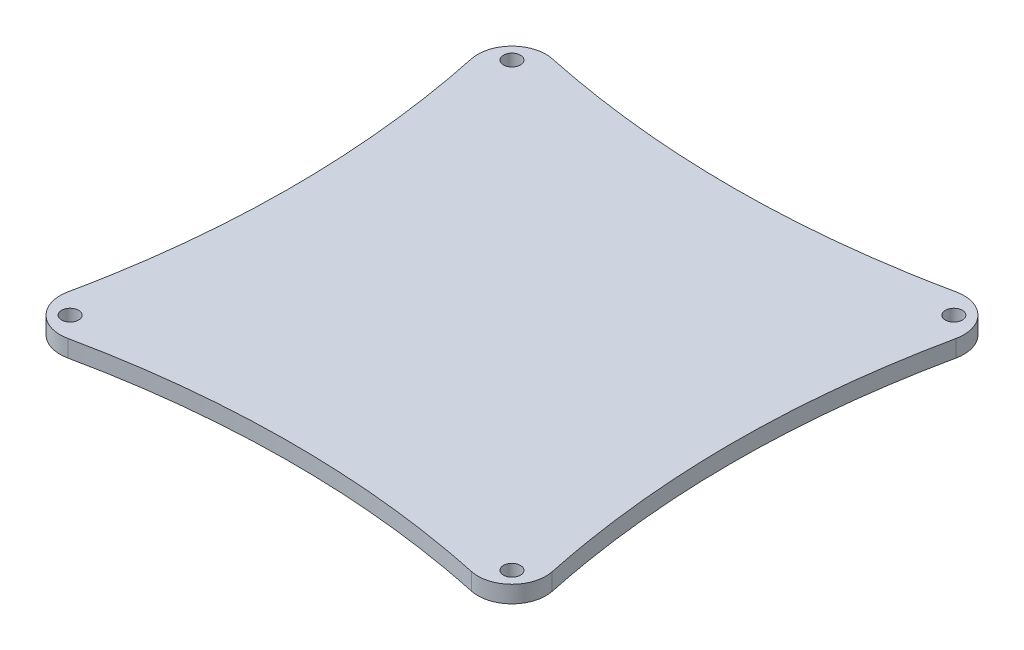
ISO-10303-21;
HEADER;
FILE_DESCRIPTION(('STEP AP214'),'2;1');
FILE_NAME('part.step','',(''),(''),'','','');
FILE_SCHEMA(('AUTOMOTIVE_DESIGN { 1 0 10303 214 1 1 1 1 }'));
ENDSEC;
DATA;
#1=APPLICATION_CONTEXT('core data for automotive mechanical design processes');
#2=APPLICATION_PROTOCOL_DEFINITION('international standard','automotive_design',2000,#1);
#3=PRODUCT_CONTEXT('',#1,'mechanical');
#4=PRODUCT('Part','Part','',(#3));
#5=PRODUCT_RELATED_PRODUCT_CATEGORY('part','',(#4));
#6=PRODUCT_DEFINITION_FORMATION('','',#4);
#7=PRODUCT_DEFINITION_CONTEXT('part definition',#1,'design');
#8=PRODUCT_DEFINITION('design','',#6,#7);
#9=PRODUCT_DEFINITION_SHAPE('','',#8);
#10=(LENGTH_UNIT() NAMED_UNIT(*) SI_UNIT(.MILLI.,.METRE.));
#11=(NAMED_UNIT(*) PLANE_ANGLE_UNIT() SI_UNIT($,.RADIAN.));
#12=(NAMED_UNIT(*) SI_UNIT($,.STERADIAN.) SOLID_ANGLE_UNIT());
#13=UNCERTAINTY_MEASURE_WITH_UNIT(LENGTH_MEASURE(1.E-05),#10,'distance_accuracy_value','');
#14=(GEOMETRIC_REPRESENTATION_CONTEXT(3) GLOBAL_UNCERTAINTY_ASSIGNED_CONTEXT((#13)) GLOBAL_UNIT_ASSIGNED_CONTEXT((#10,
#11,#12)) REPRESENTATION_CONTEXT('',''));
#15=CARTESIAN_POINT('',(0.,0.,0.));
#16=DIRECTION('',(0.,0.,1.));
#17=DIRECTION('',(1.,0.,0.));
#18=AXIS2_PLACEMENT_3D('',#15,#16,#17);
#19=CARTESIAN_POINT('',(173.322472128066,3.175,-173.342498930192));
#20=DIRECTION('',(0.,-1.,0.));
#21=DIRECTION('',(0.,0.,-1.));
#22=AXIS2_PLACEMENT_3D('',#19,#20,#21);
#23=CYLINDRICAL_SURFACE('',#22,12.7);
#24=CARTESIAN_POINT('',(173.322472128065,0.,-173.34249893019));
#25=DIRECTION('',(0.,1.,0.));
#26=DIRECTION('',(0.,0.,1.));
#27=AXIS2_PLACEMENT_3D('',#24,#25,#26);
#28=CIRCLE('',#27,12.7);
#29=CARTESIAN_POINT('',(170.697797431039,0.,-185.768322151804));
#30=VERTEX_POINT('',#29);
#31=CARTESIAN_POINT('',(185.746749635017,0.,-170.710517085599));
#32=VERTEX_POINT('',#31);
#33=EDGE_CURVE('E175',#30,#32,#28,.F.);
#34=ORIENTED_EDGE('',*,*,#33,.F.);
#35=DIRECTION('',(0.,-1.,0.));
#36=VECTOR('',#35,1.);
#37=CARTESIAN_POINT('',(170.697797431039,6.35,-185.768322151804));
#38=LINE('',#37,#36);
#39=CARTESIAN_POINT('',(170.697797431039,6.35,-185.768322151804));
#40=VERTEX_POINT('',#39);
#41=EDGE_CURVE('E115',#40,#30,#38,.T.);
#42=ORIENTED_EDGE('',*,*,#41,.F.);
#43=CARTESIAN_POINT('',(173.322472128065,6.35,-173.34249893019));
#44=DIRECTION('',(0.,1.,0.));
#45=DIRECTION('',(0.,0.,1.));
#46=AXIS2_PLACEMENT_3D('',#43,#44,#45);
#47=CIRCLE('',#46,12.7);
#48=CARTESIAN_POINT('',(185.746749635017,6.35,-170.710517085599));
#49=VERTEX_POINT('',#48);
#50=EDGE_CURVE('E122',#40,#49,#47,.F.);
#51=ORIENTED_EDGE('',*,*,#50,.T.);
#52=DIRECTION('',(0.,-1.,0.));
#53=VECTOR('',#52,1.);
#54=CARTESIAN_POINT('',(185.746749635017,6.35,-170.710517085599));
#55=LINE('',#54,#53);
#56=EDGE_CURVE('E172',#49,#32,#55,.T.);
#57=ORIENTED_EDGE('',*,*,#56,.T.);
#58=EDGE_LOOP('',(#34,#42,#51,#57));
#59=FACE_BOUND('',#58,.T.);
#60=ADVANCED_FACE('F35',(#59),#23,.T.);
#61=CARTESIAN_POINT('',(173.349019247905,3.175,-17.1466710257305));
#62=DIRECTION('',(0.,-1.,0.));
#63=DIRECTION('',(0.,0.,-1.));
#64=AXIS2_PLACEMENT_3D('',#61,#62,#63);
#65=CYLINDRICAL_SURFACE('',#64,12.7);
#66=CARTESIAN_POINT('',(173.349019247892,0.,-17.1466710257332));
#67=DIRECTION('',(0.,1.,0.));
#68=DIRECTION('',(0.,0.,1.));
#69=AXIS2_PLACEMENT_3D('',#66,#67,#68);
#70=CIRCLE('',#69,12.7);
#71=CARTESIAN_POINT('',(185.773513411456,0.,-19.7776299344923));
#72=VERTEX_POINT('',#71);
#73=CARTESIAN_POINT('',(170.697797431039,0.,-4.72648492093428));
#74=VERTEX_POINT('',#73);
#75=EDGE_CURVE('E187',#72,#74,#70,.F.);
#76=ORIENTED_EDGE('',*,*,#75,.F.);
#77=DIRECTION('',(0.,-1.,0.));
#78=VECTOR('',#77,1.);
#79=CARTESIAN_POINT('',(185.773513411456,6.35,-19.7776299344923));
#80=LINE('',#79,#78);
#81=CARTESIAN_POINT('',(185.773513411456,6.35,-19.7776299344923));
#82=VERTEX_POINT('',#81);
#83=EDGE_CURVE('E177',#82,#72,#80,.T.);
#84=ORIENTED_EDGE('',*,*,#83,.F.);
#85=CARTESIAN_POINT('',(173.349019247892,6.35,-17.1466710257332));
#86=DIRECTION('',(0.,1.,0.));
#87=DIRECTION('',(0.,0.,1.));
#88=AXIS2_PLACEMENT_3D('',#85,#86,#87);
#89=CIRCLE('',#88,12.7);
#90=CARTESIAN_POINT('',(170.697797431039,6.35,-4.72648492093428));
#91=VERTEX_POINT('',#90);
#92=EDGE_CURVE('E166',#82,#91,#89,.F.);
#93=ORIENTED_EDGE('',*,*,#92,.T.);
#94=DIRECTION('',(0.,-1.,0.));
#95=VECTOR('',#94,1.);
#96=CARTESIAN_POINT('',(170.697797431039,6.35,-4.72648492093428));
#97=LINE('',#96,#95);
#98=EDGE_CURVE('E43',#91,#74,#97,.T.);
#99=ORIENTED_EDGE('',*,*,#98,.T.);
#100=EDGE_LOOP('',(#76,#84,#93,#99));
#101=FACE_BOUND('',#100,.T.);
#102=ADVANCED_FACE('F185',(#101),#65,.T.);
#103=CARTESIAN_POINT('',(17.1829414635356,3.175,-17.1829163185345));
#104=DIRECTION('',(0.,-1.,0.));
#105=DIRECTION('',(0.,0.,-1.));
#106=AXIS2_PLACEMENT_3D('',#103,#104,#105);
#107=CYLINDRICAL_SURFACE('',#106,12.7);
#108=CARTESIAN_POINT('',(17.182941463536,0.,-17.1829163185367));
#109=DIRECTION('',(0.,1.,0.));
#110=DIRECTION('',(0.,0.,1.));
#111=AXIS2_PLACEMENT_3D('',#108,#109,#110);
#112=CIRCLE('',#111,12.7);
#113=CARTESIAN_POINT('',(4.75848888429607,0.,-19.8140715982983));
#114=VERTEX_POINT('',#113);
#115=CARTESIAN_POINT('',(19.8140882518395,0.,-4.75846194104384));
#116=VERTEX_POINT('',#115);
#117=EDGE_CURVE('E195',#114,#116,#112,.T.);
#118=ORIENTED_EDGE('',*,*,#117,.T.);
#119=DIRECTION('',(0.,-1.,0.));
#120=VECTOR('',#119,1.);
#121=CARTESIAN_POINT('',(19.8140882518395,6.35,-4.75846194104384));
#122=LINE('',#121,#120);
#123=CARTESIAN_POINT('',(19.8140882518395,6.35,-4.75846194104384));
#124=VERTEX_POINT('',#123);
#125=EDGE_CURVE('E11',#124,#116,#122,.T.);
#126=ORIENTED_EDGE('',*,*,#125,.F.);
#127=CARTESIAN_POINT('',(17.182941463536,6.35,-17.1829163185367));
#128=DIRECTION('',(0.,1.,0.));
#129=DIRECTION('',(0.,0.,1.));
#130=AXIS2_PLACEMENT_3D('',#127,#128,#129);
#131=CIRCLE('',#130,12.7);
#132=CARTESIAN_POINT('',(4.75848888429607,6.35,-19.8140715982983));
#133=VERTEX_POINT('',#132);
#134=EDGE_CURVE('E228',#133,#124,#131,.T.);
#135=ORIENTED_EDGE('',*,*,#134,.F.);
#136=DIRECTION('',(0.,-1.,0.));
#137=VECTOR('',#136,1.);
#138=CARTESIAN_POINT('',(4.75848888429607,6.35,-19.8140715982983));
#139=LINE('',#138,#137);
#140=EDGE_CURVE('E126',#133,#114,#139,.T.);
#141=ORIENTED_EDGE('',*,*,#140,.T.);
#142=EDGE_LOOP('',(#118,#126,#135,#141));
#143=FACE_BOUND('',#142,.T.);
#144=ADVANCED_FACE('F227',(#143),#107,.T.);
#145=CARTESIAN_POINT('',(17.1575077953163,3.175,-173.322440287928));
#146=DIRECTION('',(0.,-1.,0.));
#147=DIRECTION('',(0.,0.,-1.));
#148=AXIS2_PLACEMENT_3D('',#145,#146,#147);
#149=CYLINDRICAL_SURFACE('',#148,12.7);
#150=CARTESIAN_POINT('',(17.1575077953184,0.,-173.322440287928));
#151=DIRECTION('',(0.,1.,0.));
#152=DIRECTION('',(0.,0.,1.));
#153=AXIS2_PLACEMENT_3D('',#150,#151,#152);
#154=CIRCLE('',#153,12.7);
#155=CARTESIAN_POINT('',(4.73168435694636,0.,-170.697766617087));
#156=VERTEX_POINT('',#155);
#157=CARTESIAN_POINT('',(19.78949709556,0.,-185.746716215458));
#158=VERTEX_POINT('',#157);
#159=EDGE_CURVE('E213',#156,#158,#154,.F.);
#160=ORIENTED_EDGE('',*,*,#159,.F.);
#161=DIRECTION('',(0.,-1.,0.));
#162=VECTOR('',#161,1.);
#163=CARTESIAN_POINT('',(4.73168435694636,6.35,-170.697766617087));
#164=LINE('',#163,#162);
#165=CARTESIAN_POINT('',(4.73168435694636,6.35,-170.697766617087));
#166=VERTEX_POINT('',#165);
#167=EDGE_CURVE('E79',#166,#156,#164,.T.);
#168=ORIENTED_EDGE('',*,*,#167,.F.);
#169=CARTESIAN_POINT('',(17.1575077953184,6.35,-173.322440287928));
#170=DIRECTION('',(0.,1.,0.));
#171=DIRECTION('',(0.,0.,1.));
#172=AXIS2_PLACEMENT_3D('',#169,#170,#171);
#173=CIRCLE('',#172,12.7);
#174=CARTESIAN_POINT('',(19.78949709556,6.35,-185.746716215458));
#175=VERTEX_POINT('',#174);
#176=EDGE_CURVE('E119',#166,#175,#173,.F.);
#177=ORIENTED_EDGE('',*,*,#176,.T.);
#178=DIRECTION('',(0.,-1.,0.));
#179=VECTOR('',#178,1.);
#180=CARTESIAN_POINT('',(19.78949709556,6.35,-185.746716215458));
#181=LINE('',#180,#179);
#182=EDGE_CURVE('E105',#175,#158,#181,.T.);
#183=ORIENTED_EDGE('',*,*,#182,.T.);
#184=EDGE_LOOP('',(#160,#168,#177,#183));
#185=FACE_BOUND('',#184,.T.);
#186=ADVANCED_FACE('F124',(#185),#149,.T.);
#187=CARTESIAN_POINT('',(19.8140882518395,6.35,-4.75846194104384));
#188=CARTESIAN_POINT('',(44.8371963997863,6.35,-10.057646004705));
#189=CARTESIAN_POINT('',(95.3044221773575,6.35,-15.3264775848769));
#190=CARTESIAN_POINT('',(145.574109724461,6.35,-10.0894052834637));
#191=CARTESIAN_POINT('',(170.697797431039,6.35,-4.72648492093429));
#192=B_SPLINE_CURVE_WITH_KNOTS('',3,(#187,#188,#189,#190,#191),.UNSPECIFIED.,.F.,.F.,(4,1,4),
(0.104614208546919,0.50035773003242,0.896180420296307),.UNSPECIFIED.);
#193=DIRECTION('',(0.,-1.,0.));
#194=VECTOR('',#193,1.);
#195=SURFACE_OF_LINEAR_EXTRUSION('',#192,#194);
#196=CARTESIAN_POINT('',(19.8140882518395,0.,-4.75846194104384));
#197=CARTESIAN_POINT('',(44.8371963997863,0.,-10.057646004705));
#198=CARTESIAN_POINT('',(95.3044221773575,0.,-15.3264775848769));
#199=CARTESIAN_POINT('',(145.574109724461,0.,-10.0894052834637));
#200=CARTESIAN_POINT('',(170.697797431039,0.,-4.72648492093429));
#201=B_SPLINE_CURVE_WITH_KNOTS('',3,(#196,#197,#198,#199,#200),.UNSPECIFIED.,.F.,.F.,(4,1,4),
(0.104614208546919,0.50035773003242,0.896180420296307),.UNSPECIFIED.);
#202=EDGE_CURVE('E190',#116,#74,#201,.T.);
#203=ORIENTED_EDGE('',*,*,#202,.T.);
#204=ORIENTED_EDGE('',*,*,#98,.F.);
#205=EDGE_CURVE('E90',#124,#91,#192,.T.);
#206=ORIENTED_EDGE('',*,*,#205,.F.);
#207=ORIENTED_EDGE('',*,*,#125,.T.);
#208=EDGE_LOOP('',(#203,#204,#206,#207));
#209=FACE_BOUND('',#208,.T.);
#210=ADVANCED_FACE('F156',(#209),#195,.F.);
#211=CARTESIAN_POINT('',(185.746749635017,6.35,-170.710517085599));
#212=CARTESIAN_POINT('',(180.44493801681,6.35,-145.683300819084));
#213=CARTESIAN_POINT('',(175.152166761295,6.35,-95.191632251134));
#214=CARTESIAN_POINT('',(180.450729476529,6.35,-44.9140536592785));
#215=CARTESIAN_POINT('',(185.773513411456,6.35,-19.7776299344923));
#216=B_SPLINE_CURVE_WITH_KNOTS('',3,(#211,#212,#213,#214,#215),.UNSPECIFIED.,.F.,.F.,(4,1,4),
(0.104484496174819,0.500294391382567,0.896180420296308),.UNSPECIFIED.);
#217=DIRECTION('',(0.,-1.,0.));
#218=VECTOR('',#217,1.);
#219=SURFACE_OF_LINEAR_EXTRUSION('',#216,#218);
#220=CARTESIAN_POINT('',(185.746749635017,0.,-170.710517085599));
#221=CARTESIAN_POINT('',(180.44493801681,0.,-145.683300819084));
#222=CARTESIAN_POINT('',(175.152166761295,0.,-95.191632251134));
#223=CARTESIAN_POINT('',(180.450729476529,0.,-44.9140536592785));
#224=CARTESIAN_POINT('',(185.773513411456,0.,-19.7776299344923));
#225=B_SPLINE_CURVE_WITH_KNOTS('',3,(#220,#221,#222,#223,#224),.UNSPECIFIED.,.F.,.F.,(4,1,4),
(0.104484496174819,0.500294391382567,0.896180420296308),.UNSPECIFIED.);
#226=EDGE_CURVE('E197',#32,#72,#225,.T.);
#227=ORIENTED_EDGE('',*,*,#226,.F.);
#228=ORIENTED_EDGE('',*,*,#56,.F.);
#229=EDGE_CURVE('E160',#49,#82,#216,.T.);
#230=ORIENTED_EDGE('',*,*,#229,.T.);
#231=ORIENTED_EDGE('',*,*,#83,.T.);
#232=EDGE_LOOP('',(#227,#228,#230,#231));
#233=FACE_BOUND('',#232,.T.);
#234=ADVANCED_FACE('F152',(#233),#219,.T.);
#235=CARTESIAN_POINT('',(19.78949709556,6.35,-185.746716215458));
#236=CARTESIAN_POINT('',(44.8165997125433,6.35,-180.444912980548));
#237=CARTESIAN_POINT('',(95.3011699201255,6.35,-175.147507505945));
#238=CARTESIAN_POINT('',(145.567291034131,6.35,-180.460069886551));
#239=CARTESIAN_POINT('',(170.697797431039,6.35,-185.768322151804));
#240=B_SPLINE_CURVE_WITH_KNOTS('',3,(#235,#236,#237,#238,#239),.UNSPECIFIED.,.F.,.F.,(4,1,4),
(0.104485326636814,0.500295423838561,0.896051430089074),.UNSPECIFIED.);
#241=DIRECTION('',(0.,-1.,0.));
#242=VECTOR('',#241,1.);
#243=SURFACE_OF_LINEAR_EXTRUSION('',#240,#242);
#244=CARTESIAN_POINT('',(19.78949709556,0.,-185.746716215458));
#245=CARTESIAN_POINT('',(44.8165997125433,0.,-180.444912980548));
#246=CARTESIAN_POINT('',(95.3011699201255,0.,-175.147507505945));
#247=CARTESIAN_POINT('',(145.567291034131,0.,-180.460069886551));
#248=CARTESIAN_POINT('',(170.697797431039,0.,-185.768322151804));
#249=B_SPLINE_CURVE_WITH_KNOTS('',3,(#244,#245,#246,#247,#248),.UNSPECIFIED.,.F.,.F.,(4,1,4),
(0.104485326636814,0.500295423838561,0.896051430089074),.UNSPECIFIED.);
#250=EDGE_CURVE('E110',#158,#30,#249,.T.);
#251=ORIENTED_EDGE('',*,*,#250,.F.);
#252=ORIENTED_EDGE('',*,*,#182,.F.);
#253=EDGE_CURVE('E108',#175,#40,#240,.T.);
#254=ORIENTED_EDGE('',*,*,#253,.T.);
#255=ORIENTED_EDGE('',*,*,#41,.T.);
#256=EDGE_LOOP('',(#251,#252,#254,#255));
#257=FACE_BOUND('',#256,.T.);
#258=ADVANCED_FACE('F107',(#257),#243,.T.);
#259=CARTESIAN_POINT('',(177.8,6.35,-177.8));
#260=DIRECTION('',(0.,-1.,0.));
#261=DIRECTION('',(0.,0.,-1.));
#262=AXIS2_PLACEMENT_3D('',#259,#260,#261);
#263=CYLINDRICAL_SURFACE('',#262,3.175);
#264=CARTESIAN_POINT('',(177.8,6.35,-177.8));
#265=DIRECTION('',(0.,1.,0.));
#266=DIRECTION('',(0.,0.,1.));
#267=AXIS2_PLACEMENT_3D('',#264,#265,#266);
#268=CIRCLE('',#267,3.175);
#269=CARTESIAN_POINT('',(177.8,6.35,-174.625));
#270=VERTEX_POINT('',#269);
#271=EDGE_CURVE('E353',#270,#270,#268,.T.);
#272=ORIENTED_EDGE('',*,*,#271,.T.);
#273=EDGE_LOOP('',(#272));
#274=FACE_BOUND('',#273,.T.);
#275=CARTESIAN_POINT('',(177.8,0.,-177.8));
#276=DIRECTION('',(0.,1.,0.));
#277=DIRECTION('',(0.,0.,1.));
#278=AXIS2_PLACEMENT_3D('',#275,#276,#277);
#279=CIRCLE('',#278,3.175);
#280=CARTESIAN_POINT('',(177.8,0.,-174.625));
#281=VERTEX_POINT('',#280);
#282=EDGE_CURVE('E229',#281,#281,#279,.T.);
#283=ORIENTED_EDGE('',*,*,#282,.F.);
#284=EDGE_LOOP('',(#283));
#285=FACE_BOUND('',#284,.T.);
#286=ADVANCED_FACE('F151',(#274,#285),#263,.F.);
#287=CARTESIAN_POINT('',(177.8,6.35,-12.7));
#288=DIRECTION('',(0.,-1.,0.));
#289=DIRECTION('',(0.,0.,-1.));
#290=AXIS2_PLACEMENT_3D('',#287,#288,#289);
#291=CYLINDRICAL_SURFACE('',#290,3.175);
#292=CARTESIAN_POINT('',(177.8,6.35,-12.7));
#293=DIRECTION('',(0.,1.,0.));
#294=DIRECTION('',(0.,0.,1.));
#295=AXIS2_PLACEMENT_3D('',#292,#293,#294);
#296=CIRCLE('',#295,3.175);
#297=CARTESIAN_POINT('',(177.8,6.35,-9.52499999999999));
#298=VERTEX_POINT('',#297);
#299=EDGE_CURVE('E350',#298,#298,#296,.T.);
#300=ORIENTED_EDGE('',*,*,#299,.T.);
#301=EDGE_LOOP('',(#300));
#302=FACE_BOUND('',#301,.T.);
#303=CARTESIAN_POINT('',(177.8,0.,-12.7));
#304=DIRECTION('',(0.,1.,0.));
#305=DIRECTION('',(0.,0.,1.));
#306=AXIS2_PLACEMENT_3D('',#303,#304,#305);
#307=CIRCLE('',#306,3.175);
#308=CARTESIAN_POINT('',(177.8,0.,-9.52499999999999));
#309=VERTEX_POINT('',#308);
#310=EDGE_CURVE('E231',#309,#309,#307,.T.);
#311=ORIENTED_EDGE('',*,*,#310,.F.);
#312=EDGE_LOOP('',(#311));
#313=FACE_BOUND('',#312,.T.);
#314=ADVANCED_FACE('F250',(#302,#313),#291,.F.);
#315=CARTESIAN_POINT('',(12.7,6.35,-12.7));
#316=DIRECTION('',(0.,-1.,0.));
#317=DIRECTION('',(0.,0.,-1.));
#318=AXIS2_PLACEMENT_3D('',#315,#316,#317);
#319=CYLINDRICAL_SURFACE('',#318,3.175);
#320=CARTESIAN_POINT('',(12.7,6.35,-12.7));
#321=DIRECTION('',(0.,1.,0.));
#322=DIRECTION('',(0.,0.,1.));
#323=AXIS2_PLACEMENT_3D('',#320,#321,#322);
#324=CIRCLE('',#323,3.175);
#325=CARTESIAN_POINT('',(12.7,6.35,-9.52499999999999));
#326=VERTEX_POINT('',#325);
#327=EDGE_CURVE('E346',#326,#326,#324,.T.);
#328=ORIENTED_EDGE('',*,*,#327,.T.);
#329=EDGE_LOOP('',(#328));
#330=FACE_BOUND('',#329,.T.);
#331=CARTESIAN_POINT('',(12.7,0.,-12.7));
#332=DIRECTION('',(0.,1.,0.));
#333=DIRECTION('',(0.,0.,1.));
#334=AXIS2_PLACEMENT_3D('',#331,#332,#333);
#335=CIRCLE('',#334,3.175);
#336=CARTESIAN_POINT('',(12.7,0.,-9.52499999999999));
#337=VERTEX_POINT('',#336);
#338=EDGE_CURVE('E235',#337,#337,#335,.T.);
#339=ORIENTED_EDGE('',*,*,#338,.F.);
#340=EDGE_LOOP('',(#339));
#341=FACE_BOUND('',#340,.T.);
#342=ADVANCED_FACE('F244',(#330,#341),#319,.F.);
#343=CARTESIAN_POINT('',(12.7,6.35,-177.8));
#344=DIRECTION('',(0.,-1.,0.));
#345=DIRECTION('',(0.,0.,-1.));
#346=AXIS2_PLACEMENT_3D('',#343,#344,#345);
#347=CYLINDRICAL_SURFACE('',#346,3.175);
#348=CARTESIAN_POINT('',(12.7,6.35,-177.8));
#349=DIRECTION('',(0.,1.,0.));
#350=DIRECTION('',(0.,0.,1.));
#351=AXIS2_PLACEMENT_3D('',#348,#349,#350);
#352=CIRCLE('',#351,3.175);
#353=CARTESIAN_POINT('',(12.7,6.35,-174.625));
#354=VERTEX_POINT('',#353);
#355=EDGE_CURVE('E221',#354,#354,#352,.T.);
#356=ORIENTED_EDGE('',*,*,#355,.T.);
#357=EDGE_LOOP('',(#356));
#358=FACE_BOUND('',#357,.T.);
#359=CARTESIAN_POINT('',(12.7,0.,-177.8));
#360=DIRECTION('',(0.,1.,0.));
#361=DIRECTION('',(0.,0.,1.));
#362=AXIS2_PLACEMENT_3D('',#359,#360,#361);
#363=CIRCLE('',#362,3.175);
#364=CARTESIAN_POINT('',(12.7,0.,-174.625));
#365=VERTEX_POINT('',#364);
#366=EDGE_CURVE('E136',#365,#365,#363,.T.);
#367=ORIENTED_EDGE('',*,*,#366,.F.);
#368=EDGE_LOOP('',(#367));
#369=FACE_BOUND('',#368,.T.);
#370=ADVANCED_FACE('F146',(#358,#369),#347,.F.);
#371=CARTESIAN_POINT('',(4.73168435694635,6.35,-170.697766617087));
#372=CARTESIAN_POINT('',(10.0399374905727,6.35,-145.567245845276));
#373=CARTESIAN_POINT('',(15.3516219067974,6.35,-95.3095365760446));
#374=CARTESIAN_POINT('',(10.0568155491037,6.35,-44.8330466859773));
#375=CARTESIAN_POINT('',(4.75848888429606,6.35,-19.8140715982982));
#376=B_SPLINE_CURVE_WITH_KNOTS('',3,(#371,#372,#373,#374,#375),.UNSPECIFIED.,.F.,.F.,(4,1,4),
(0.103948731668706,0.499704964295737,0.895385121940053),.UNSPECIFIED.);
#377=DIRECTION('',(0.,-1.,0.));
#378=VECTOR('',#377,1.);
#379=SURFACE_OF_LINEAR_EXTRUSION('',#376,#378);
#380=CARTESIAN_POINT('',(4.73168435694635,0.,-170.697766617087));
#381=CARTESIAN_POINT('',(10.0399374905727,0.,-145.567245845276));
#382=CARTESIAN_POINT('',(15.3516219067974,0.,-95.3095365760446));
#383=CARTESIAN_POINT('',(10.0568155491037,0.,-44.8330466859773));
#384=CARTESIAN_POINT('',(4.75848888429606,0.,-19.8140715982982));
#385=B_SPLINE_CURVE_WITH_KNOTS('',3,(#380,#381,#382,#383,#384),.UNSPECIFIED.,.F.,.F.,(4,1,4),
(0.103948731668706,0.499704964295737,0.895385121940053),.UNSPECIFIED.);
#386=EDGE_CURVE('E82',#156,#114,#385,.T.);
#387=ORIENTED_EDGE('',*,*,#386,.T.);
#388=ORIENTED_EDGE('',*,*,#140,.F.);
#389=EDGE_CURVE('E51',#166,#133,#376,.T.);
#390=ORIENTED_EDGE('',*,*,#389,.F.);
#391=ORIENTED_EDGE('',*,*,#167,.T.);
#392=EDGE_LOOP('',(#387,#388,#390,#391));
#393=FACE_BOUND('',#392,.T.);
#394=ADVANCED_FACE('F142',(#393),#379,.F.);
#395=CARTESIAN_POINT('',(0.,6.35,0.));
#396=DIRECTION('',(0.,1.,0.));
#397=DIRECTION('',(0.,0.,1.));
#398=AXIS2_PLACEMENT_3D('',#395,#396,#397);
#399=PLANE('',#398);
#400=ORIENTED_EDGE('',*,*,#355,.F.);
#401=EDGE_LOOP('',(#400));
#402=FACE_BOUND('',#401,.T.);
#403=ORIENTED_EDGE('',*,*,#327,.F.);
#404=EDGE_LOOP('',(#403));
#405=FACE_BOUND('',#404,.T.);
#406=ORIENTED_EDGE('',*,*,#299,.F.);
#407=EDGE_LOOP('',(#406));
#408=FACE_BOUND('',#407,.T.);
#409=ORIENTED_EDGE('',*,*,#271,.F.);
#410=EDGE_LOOP('',(#409));
#411=FACE_BOUND('',#410,.T.);
#412=ORIENTED_EDGE('',*,*,#134,.T.);
#413=ORIENTED_EDGE('',*,*,#205,.T.);
#414=ORIENTED_EDGE('',*,*,#92,.F.);
#415=ORIENTED_EDGE('',*,*,#229,.F.);
#416=ORIENTED_EDGE('',*,*,#50,.F.);
#417=ORIENTED_EDGE('',*,*,#253,.F.);
#418=ORIENTED_EDGE('',*,*,#176,.F.);
#419=ORIENTED_EDGE('',*,*,#389,.T.);
#420=EDGE_LOOP('',(#412,#413,#414,#415,#416,#417,#418,#419));
#421=FACE_BOUND('',#420,.T.);
#422=ADVANCED_FACE('F118',(#402,#405,#408,#411,#421),#399,.T.);
#423=CARTESIAN_POINT('',(0.,0.,0.));
#424=DIRECTION('',(0.,1.,0.));
#425=DIRECTION('',(0.,0.,1.));
#426=AXIS2_PLACEMENT_3D('',#423,#424,#425);
#427=PLANE('',#426);
#428=ORIENTED_EDGE('',*,*,#366,.T.);
#429=EDGE_LOOP('',(#428));
#430=FACE_BOUND('',#429,.T.);
#431=ORIENTED_EDGE('',*,*,#338,.T.);
#432=EDGE_LOOP('',(#431));
#433=FACE_BOUND('',#432,.T.);
#434=ORIENTED_EDGE('',*,*,#310,.T.);
#435=EDGE_LOOP('',(#434));
#436=FACE_BOUND('',#435,.T.);
#437=ORIENTED_EDGE('',*,*,#282,.T.);
#438=EDGE_LOOP('',(#437));
#439=FACE_BOUND('',#438,.T.);
#440=ORIENTED_EDGE('',*,*,#117,.F.);
#441=ORIENTED_EDGE('',*,*,#386,.F.);
#442=ORIENTED_EDGE('',*,*,#159,.T.);
#443=ORIENTED_EDGE('',*,*,#250,.T.);
#444=ORIENTED_EDGE('',*,*,#33,.T.);
#445=ORIENTED_EDGE('',*,*,#226,.T.);
#446=ORIENTED_EDGE('',*,*,#75,.T.);
#447=ORIENTED_EDGE('',*,*,#202,.F.);
#448=EDGE_LOOP('',(#440,#441,#442,#443,#444,#445,#446,#447));
#449=FACE_BOUND('',#448,.T.);
#450=ADVANCED_FACE('F147',(#430,#433,#436,#439,#449),#427,.F.);
#451=CLOSED_SHELL('',(#60,#102,#144,#186,#210,#234,#258,#286,#314,#342,#370,#394,#422,#450));
#452=MANIFOLD_SOLID_BREP('B2',#451);
#453=ADVANCED_BREP_SHAPE_REPRESENTATION('',(#18,#452),#14);
#454=SHAPE_DEFINITION_REPRESENTATION(#9,#453);
ENDSEC;
END-ISO-10303-21;
